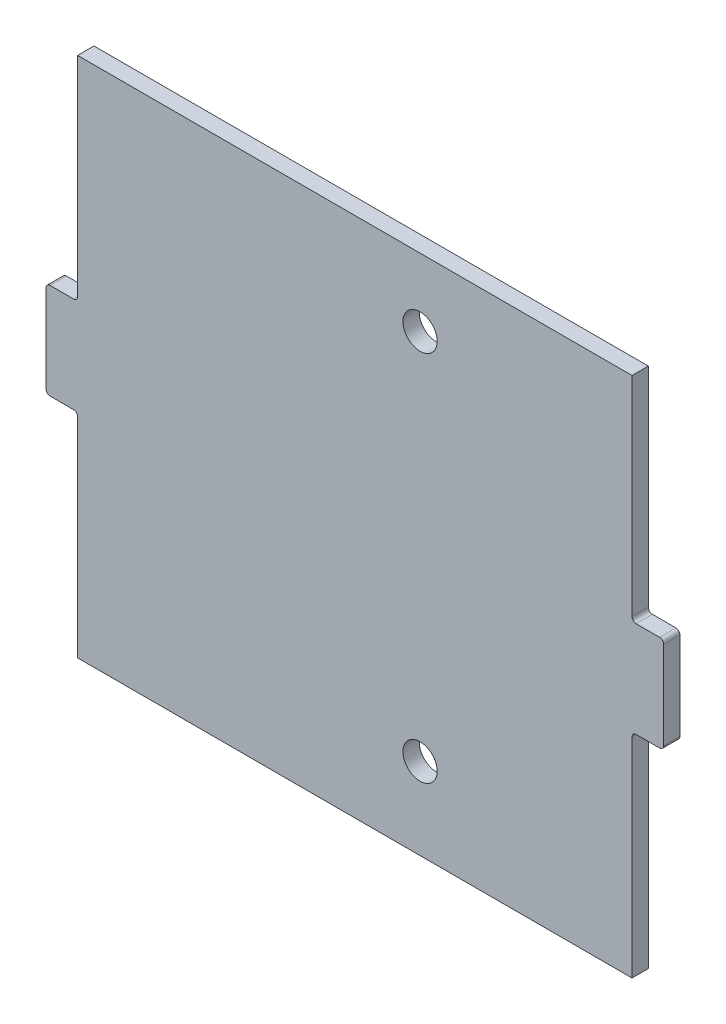
ISO-10303-21;
HEADER;
FILE_DESCRIPTION(('STEP AP214'),'2;1');
FILE_NAME('part.step','',(''),(''),'','','');
FILE_SCHEMA(('AUTOMOTIVE_DESIGN { 1 0 10303 214 1 1 1 1 }'));
ENDSEC;
DATA;
#1=APPLICATION_CONTEXT('core data for automotive mechanical design processes');
#2=APPLICATION_PROTOCOL_DEFINITION('international standard','automotive_design',2000,#1);
#3=PRODUCT_CONTEXT('',#1,'mechanical');
#4=PRODUCT('Part','Part','',(#3));
#5=PRODUCT_RELATED_PRODUCT_CATEGORY('part','',(#4));
#6=PRODUCT_DEFINITION_FORMATION('','',#4);
#7=PRODUCT_DEFINITION_CONTEXT('part definition',#1,'design');
#8=PRODUCT_DEFINITION('design','',#6,#7);
#9=PRODUCT_DEFINITION_SHAPE('','',#8);
#10=(LENGTH_UNIT() NAMED_UNIT(*) SI_UNIT(.MILLI.,.METRE.));
#11=(NAMED_UNIT(*) PLANE_ANGLE_UNIT() SI_UNIT($,.RADIAN.));
#12=(NAMED_UNIT(*) SI_UNIT($,.STERADIAN.) SOLID_ANGLE_UNIT());
#13=UNCERTAINTY_MEASURE_WITH_UNIT(LENGTH_MEASURE(1.E-05),#10,'distance_accuracy_value','');
#14=(GEOMETRIC_REPRESENTATION_CONTEXT(3) GLOBAL_UNCERTAINTY_ASSIGNED_CONTEXT((#13)) GLOBAL_UNIT_ASSIGNED_CONTEXT((#10,
#11,#12)) REPRESENTATION_CONTEXT('',''));
#15=CARTESIAN_POINT('',(0.,0.,0.));
#16=DIRECTION('',(0.,0.,1.));
#17=DIRECTION('',(1.,0.,0.));
#18=AXIS2_PLACEMENT_3D('',#15,#16,#17);
#19=CARTESIAN_POINT('',(215.9,-38.1,6.35));
#20=DIRECTION('',(-1.,0.,0.));
#21=DIRECTION('',(0.,-1.,0.));
#22=AXIS2_PLACEMENT_3D('',#19,#20,#21);
#23=PLANE('',#22);
#24=DIRECTION('',(0.,1.,0.));
#25=VECTOR('',#24,1.);
#26=CARTESIAN_POINT('',(215.9,-38.1,-6.35));
#27=LINE('',#26,#25);
#28=CARTESIAN_POINT('',(215.9,-203.2,-6.35));
#29=VERTEX_POINT('',#28);
#30=CARTESIAN_POINT('',(215.9,-40.513,-6.35));
#31=VERTEX_POINT('',#30);
#32=EDGE_CURVE('E202',#29,#31,#27,.T.);
#33=ORIENTED_EDGE('',*,*,#32,.T.);
#34=DIRECTION('',(0.,0.,-1.));
#35=VECTOR('',#34,1.);
#36=CARTESIAN_POINT('',(215.9,-40.513,6.35));
#37=LINE('',#36,#35);
#38=CARTESIAN_POINT('',(215.9,-40.513,6.35));
#39=VERTEX_POINT('',#38);
#40=EDGE_CURVE('E359',#31,#39,#37,.F.);
#41=ORIENTED_EDGE('',*,*,#40,.T.);
#42=DIRECTION('',(0.,1.,0.));
#43=VECTOR('',#42,1.);
#44=CARTESIAN_POINT('',(215.9,-38.1,6.35));
#45=LINE('',#44,#43);
#46=CARTESIAN_POINT('',(215.9,-203.2,6.35));
#47=VERTEX_POINT('',#46);
#48=EDGE_CURVE('E205',#47,#39,#45,.T.);
#49=ORIENTED_EDGE('',*,*,#48,.F.);
#50=DIRECTION('',(0.,0.,-1.));
#51=VECTOR('',#50,1.);
#52=CARTESIAN_POINT('',(215.9,-203.2,6.35));
#53=LINE('',#52,#51);
#54=EDGE_CURVE('E190',#47,#29,#53,.T.);
#55=ORIENTED_EDGE('',*,*,#54,.T.);
#56=EDGE_LOOP('',(#33,#41,#49,#55));
#57=FACE_BOUND('',#56,.T.);
#58=ADVANCED_FACE('F44',(#57),#23,.F.);
#59=CARTESIAN_POINT('',(215.9,-37.338,6.35));
#60=DIRECTION('',(0.,1.,0.));
#61=DIRECTION('',(-1.,0.,0.));
#62=AXIS2_PLACEMENT_3D('',#59,#60,#61);
#63=PLANE('',#62);
#64=DIRECTION('',(1.,0.,0.));
#65=VECTOR('',#64,1.);
#66=CARTESIAN_POINT('',(215.9,-37.338,-6.35));
#67=LINE('',#66,#65);
#68=CARTESIAN_POINT('',(219.075,-37.338,-6.35));
#69=VERTEX_POINT('',#68);
#70=CARTESIAN_POINT('',(237.363,-37.338,-6.35));
#71=VERTEX_POINT('',#70);
#72=EDGE_CURVE('E207',#69,#71,#67,.T.);
#73=ORIENTED_EDGE('',*,*,#72,.T.);
#74=DIRECTION('',(0.,0.,-1.));
#75=VECTOR('',#74,1.);
#76=CARTESIAN_POINT('',(237.363,-37.338,6.35));
#77=LINE('',#76,#75);
#78=CARTESIAN_POINT('',(237.363,-37.338,6.35));
#79=VERTEX_POINT('',#78);
#80=EDGE_CURVE('E356',#71,#79,#77,.F.);
#81=ORIENTED_EDGE('',*,*,#80,.T.);
#82=DIRECTION('',(1.,0.,0.));
#83=VECTOR('',#82,1.);
#84=CARTESIAN_POINT('',(215.9,-37.338,6.35));
#85=LINE('',#84,#83);
#86=CARTESIAN_POINT('',(219.075,-37.338,6.35));
#87=VERTEX_POINT('',#86);
#88=EDGE_CURVE('E238',#87,#79,#85,.T.);
#89=ORIENTED_EDGE('',*,*,#88,.F.);
#90=DIRECTION('',(0.,0.,-1.));
#91=VECTOR('',#90,1.);
#92=CARTESIAN_POINT('',(219.075,-37.338,-6.35));
#93=LINE('',#92,#91);
#94=EDGE_CURVE('E352',#87,#69,#93,.T.);
#95=ORIENTED_EDGE('',*,*,#94,.T.);
#96=EDGE_LOOP('',(#73,#81,#89,#95));
#97=FACE_BOUND('',#96,.T.);
#98=ADVANCED_FACE('F411',(#97),#63,.F.);
#99=CARTESIAN_POINT('',(240.538,38.1,6.35));
#100=DIRECTION('',(-1.,0.,0.));
#101=DIRECTION('',(0.,0.,1.));
#102=AXIS2_PLACEMENT_3D('',#99,#100,#101);
#103=PLANE('',#102);
#104=DIRECTION('',(0.,1.,0.));
#105=VECTOR('',#104,1.);
#106=CARTESIAN_POINT('',(240.538,38.1,-6.35));
#107=LINE('',#106,#105);
#108=CARTESIAN_POINT('',(240.538,-34.163,-6.35));
#109=VERTEX_POINT('',#108);
#110=CARTESIAN_POINT('',(240.538,34.163,-6.35));
#111=VERTEX_POINT('',#110);
#112=EDGE_CURVE('E243',#109,#111,#107,.T.);
#113=ORIENTED_EDGE('',*,*,#112,.T.);
#114=DIRECTION('',(0.,0.,-1.));
#115=VECTOR('',#114,1.);
#116=CARTESIAN_POINT('',(240.538,34.163,6.35));
#117=LINE('',#116,#115);
#118=CARTESIAN_POINT('',(240.538,34.163,6.35));
#119=VERTEX_POINT('',#118);
#120=EDGE_CURVE('E349',#111,#119,#117,.F.);
#121=ORIENTED_EDGE('',*,*,#120,.T.);
#122=DIRECTION('',(0.,1.,0.));
#123=VECTOR('',#122,1.);
#124=CARTESIAN_POINT('',(240.538,38.1,6.35));
#125=LINE('',#124,#123);
#126=CARTESIAN_POINT('',(240.538,-34.163,6.35));
#127=VERTEX_POINT('',#126);
#128=EDGE_CURVE('E247',#127,#119,#125,.T.);
#129=ORIENTED_EDGE('',*,*,#128,.F.);
#130=DIRECTION('',(0.,0.,-1.));
#131=VECTOR('',#130,1.);
#132=CARTESIAN_POINT('',(240.538,-34.163,6.35));
#133=LINE('',#132,#131);
#134=EDGE_CURVE('E345',#127,#109,#133,.T.);
#135=ORIENTED_EDGE('',*,*,#134,.T.);
#136=EDGE_LOOP('',(#113,#121,#129,#135));
#137=FACE_BOUND('',#136,.T.);
#138=ADVANCED_FACE('F416',(#137),#103,.F.);
#139=CARTESIAN_POINT('',(215.9,37.338,6.35));
#140=DIRECTION('',(0.,-1.,0.));
#141=DIRECTION('',(0.,0.,-1.));
#142=AXIS2_PLACEMENT_3D('',#139,#140,#141);
#143=PLANE('',#142);
#144=DIRECTION('',(-1.,0.,0.));
#145=VECTOR('',#144,1.);
#146=CARTESIAN_POINT('',(215.9,37.338,-6.35));
#147=LINE('',#146,#145);
#148=CARTESIAN_POINT('',(237.363,37.338,-6.35));
#149=VERTEX_POINT('',#148);
#150=CARTESIAN_POINT('',(219.075,37.338,-6.35));
#151=VERTEX_POINT('',#150);
#152=EDGE_CURVE('E254',#149,#151,#147,.T.);
#153=ORIENTED_EDGE('',*,*,#152,.T.);
#154=DIRECTION('',(0.,0.,-1.));
#155=VECTOR('',#154,1.);
#156=CARTESIAN_POINT('',(219.075,37.338,6.35));
#157=LINE('',#156,#155);
#158=CARTESIAN_POINT('',(219.075,37.338,6.35));
#159=VERTEX_POINT('',#158);
#160=EDGE_CURVE('E342',#151,#159,#157,.F.);
#161=ORIENTED_EDGE('',*,*,#160,.T.);
#162=DIRECTION('',(-1.,0.,0.));
#163=VECTOR('',#162,1.);
#164=CARTESIAN_POINT('',(215.9,37.338,6.35));
#165=LINE('',#164,#163);
#166=CARTESIAN_POINT('',(237.363,37.338,6.35));
#167=VERTEX_POINT('',#166);
#168=EDGE_CURVE('E235',#167,#159,#165,.T.);
#169=ORIENTED_EDGE('',*,*,#168,.F.);
#170=DIRECTION('',(0.,0.,-1.));
#171=VECTOR('',#170,1.);
#172=CARTESIAN_POINT('',(237.363,37.338,6.35));
#173=LINE('',#172,#171);
#174=EDGE_CURVE('E338',#167,#149,#173,.T.);
#175=ORIENTED_EDGE('',*,*,#174,.T.);
#176=EDGE_LOOP('',(#153,#161,#169,#175));
#177=FACE_BOUND('',#176,.T.);
#178=ADVANCED_FACE('F424',(#177),#143,.F.);
#179=CARTESIAN_POINT('',(215.9,203.2,6.35));
#180=DIRECTION('',(-1.,0.,0.));
#181=DIRECTION('',(0.,-1.,0.));
#182=AXIS2_PLACEMENT_3D('',#179,#180,#181);
#183=PLANE('',#182);
#184=DIRECTION('',(0.,1.,0.));
#185=VECTOR('',#184,1.);
#186=CARTESIAN_POINT('',(215.9,203.2,6.35));
#187=LINE('',#186,#185);
#188=CARTESIAN_POINT('',(215.9,40.513,6.35));
#189=VERTEX_POINT('',#188);
#190=CARTESIAN_POINT('',(215.9,203.2,6.35));
#191=VERTEX_POINT('',#190);
#192=EDGE_CURVE('E232',#189,#191,#187,.T.);
#193=ORIENTED_EDGE('',*,*,#192,.F.);
#194=DIRECTION('',(0.,0.,-1.));
#195=VECTOR('',#194,1.);
#196=CARTESIAN_POINT('',(215.9,40.513,-6.35));
#197=LINE('',#196,#195);
#198=CARTESIAN_POINT('',(215.9,40.513,-6.35));
#199=VERTEX_POINT('',#198);
#200=EDGE_CURVE('E334',#189,#199,#197,.T.);
#201=ORIENTED_EDGE('',*,*,#200,.T.);
#202=DIRECTION('',(0.,1.,0.));
#203=VECTOR('',#202,1.);
#204=CARTESIAN_POINT('',(215.9,203.2,-6.35));
#205=LINE('',#204,#203);
#206=CARTESIAN_POINT('',(215.9,203.2,-6.35));
#207=VERTEX_POINT('',#206);
#208=EDGE_CURVE('E216',#199,#207,#205,.T.);
#209=ORIENTED_EDGE('',*,*,#208,.T.);
#210=DIRECTION('',(0.,0.,-1.));
#211=VECTOR('',#210,1.);
#212=CARTESIAN_POINT('',(215.9,203.2,6.35));
#213=LINE('',#212,#211);
#214=EDGE_CURVE('E571',#191,#207,#213,.T.);
#215=ORIENTED_EDGE('',*,*,#214,.F.);
#216=EDGE_LOOP('',(#193,#201,#209,#215));
#217=FACE_BOUND('',#216,.T.);
#218=ADVANCED_FACE('F420',(#217),#183,.F.);
#219=CARTESIAN_POINT('',(-215.9,203.2,6.35));
#220=DIRECTION('',(0.,-1.,0.));
#221=DIRECTION('',(0.,0.,-1.));
#222=AXIS2_PLACEMENT_3D('',#219,#220,#221);
#223=PLANE('',#222);
#224=DIRECTION('',(-1.,0.,0.));
#225=VECTOR('',#224,1.);
#226=CARTESIAN_POINT('',(-215.9,203.2,-6.35));
#227=LINE('',#226,#225);
#228=CARTESIAN_POINT('',(-215.9,203.2,-6.35));
#229=VERTEX_POINT('',#228);
#230=EDGE_CURVE('E576',#207,#229,#227,.T.);
#231=ORIENTED_EDGE('',*,*,#230,.T.);
#232=DIRECTION('',(0.,0.,-1.));
#233=VECTOR('',#232,1.);
#234=CARTESIAN_POINT('',(-215.9,203.2,6.35));
#235=LINE('',#234,#233);
#236=CARTESIAN_POINT('',(-215.9,203.2,6.35));
#237=VERTEX_POINT('',#236);
#238=EDGE_CURVE('E265',#237,#229,#235,.T.);
#239=ORIENTED_EDGE('',*,*,#238,.F.);
#240=DIRECTION('',(-1.,0.,0.));
#241=VECTOR('',#240,1.);
#242=CARTESIAN_POINT('',(-215.9,203.2,6.35));
#243=LINE('',#242,#241);
#244=EDGE_CURVE('E229',#191,#237,#243,.T.);
#245=ORIENTED_EDGE('',*,*,#244,.F.);
#246=ORIENTED_EDGE('',*,*,#214,.T.);
#247=EDGE_LOOP('',(#231,#239,#245,#246));
#248=FACE_BOUND('',#247,.T.);
#249=ADVANCED_FACE('F423',(#248),#223,.F.);
#250=CARTESIAN_POINT('',(-215.9,203.2,6.35));
#251=DIRECTION('',(1.,0.,0.));
#252=DIRECTION('',(0.,0.,-1.));
#253=AXIS2_PLACEMENT_3D('',#250,#251,#252);
#254=PLANE('',#253);
#255=DIRECTION('',(0.,-1.,0.));
#256=VECTOR('',#255,1.);
#257=CARTESIAN_POINT('',(-215.9,203.2,-6.35));
#258=LINE('',#257,#256);
#259=CARTESIAN_POINT('',(-215.9,40.513,-6.35));
#260=VERTEX_POINT('',#259);
#261=EDGE_CURVE('E575',#229,#260,#258,.T.);
#262=ORIENTED_EDGE('',*,*,#261,.T.);
#263=DIRECTION('',(0.,0.,-1.));
#264=VECTOR('',#263,1.);
#265=CARTESIAN_POINT('',(-215.9,40.513,6.35));
#266=LINE('',#265,#264);
#267=CARTESIAN_POINT('',(-215.9,40.513,6.35));
#268=VERTEX_POINT('',#267);
#269=EDGE_CURVE('E331',#260,#268,#266,.F.);
#270=ORIENTED_EDGE('',*,*,#269,.T.);
#271=DIRECTION('',(0.,-1.,0.));
#272=VECTOR('',#271,1.);
#273=CARTESIAN_POINT('',(-215.9,203.2,6.35));
#274=LINE('',#273,#272);
#275=EDGE_CURVE('E225',#237,#268,#274,.T.);
#276=ORIENTED_EDGE('',*,*,#275,.F.);
#277=ORIENTED_EDGE('',*,*,#238,.T.);
#278=EDGE_LOOP('',(#262,#270,#276,#277));
#279=FACE_BOUND('',#278,.T.);
#280=ADVANCED_FACE('F428',(#279),#254,.F.);
#281=CARTESIAN_POINT('',(-215.9,37.338,6.35));
#282=DIRECTION('',(0.,-1.,0.));
#283=DIRECTION('',(1.,0.,0.));
#284=AXIS2_PLACEMENT_3D('',#281,#282,#283);
#285=PLANE('',#284);
#286=DIRECTION('',(-1.,0.,0.));
#287=VECTOR('',#286,1.);
#288=CARTESIAN_POINT('',(-215.9,37.338,6.35));
#289=LINE('',#288,#287);
#290=CARTESIAN_POINT('',(-219.075,37.338,6.35));
#291=VERTEX_POINT('',#290);
#292=CARTESIAN_POINT('',(-237.363,37.338,6.35));
#293=VERTEX_POINT('',#292);
#294=EDGE_CURVE('E228',#291,#293,#289,.T.);
#295=ORIENTED_EDGE('',*,*,#294,.F.);
#296=DIRECTION('',(0.,0.,-1.));
#297=VECTOR('',#296,1.);
#298=CARTESIAN_POINT('',(-219.075,37.338,-6.35));
#299=LINE('',#298,#297);
#300=CARTESIAN_POINT('',(-219.075,37.338,-6.35));
#301=VERTEX_POINT('',#300);
#302=EDGE_CURVE('E327',#291,#301,#299,.T.);
#303=ORIENTED_EDGE('',*,*,#302,.T.);
#304=DIRECTION('',(-1.,0.,0.));
#305=VECTOR('',#304,1.);
#306=CARTESIAN_POINT('',(-215.9,37.338,-6.35));
#307=LINE('',#306,#305);
#308=CARTESIAN_POINT('',(-237.363,37.338,-6.35));
#309=VERTEX_POINT('',#308);
#310=EDGE_CURVE('E261',#301,#309,#307,.T.);
#311=ORIENTED_EDGE('',*,*,#310,.T.);
#312=DIRECTION('',(0.,0.,-1.));
#313=VECTOR('',#312,1.);
#314=CARTESIAN_POINT('',(-237.363,37.338,6.35));
#315=LINE('',#314,#313);
#316=EDGE_CURVE('E62',#309,#293,#315,.F.);
#317=ORIENTED_EDGE('',*,*,#316,.T.);
#318=EDGE_LOOP('',(#295,#303,#311,#317));
#319=FACE_BOUND('',#318,.T.);
#320=ADVANCED_FACE('F432',(#319),#285,.F.);
#321=CARTESIAN_POINT('',(-240.538,38.1,6.35));
#322=DIRECTION('',(1.,0.,0.));
#323=DIRECTION('',(0.,0.,-1.));
#324=AXIS2_PLACEMENT_3D('',#321,#322,#323);
#325=PLANE('',#324);
#326=DIRECTION('',(0.,-1.,0.));
#327=VECTOR('',#326,1.);
#328=CARTESIAN_POINT('',(-240.538,38.1,-6.35));
#329=LINE('',#328,#327);
#330=CARTESIAN_POINT('',(-240.538,34.163,-6.35));
#331=VERTEX_POINT('',#330);
#332=CARTESIAN_POINT('',(-240.538,-34.163,-6.35));
#333=VERTEX_POINT('',#332);
#334=EDGE_CURVE('E264',#331,#333,#329,.T.);
#335=ORIENTED_EDGE('',*,*,#334,.T.);
#336=DIRECTION('',(0.,0.,-1.));
#337=VECTOR('',#336,1.);
#338=CARTESIAN_POINT('',(-240.538,-34.163,6.35));
#339=LINE('',#338,#337);
#340=CARTESIAN_POINT('',(-240.538,-34.163,6.35));
#341=VERTEX_POINT('',#340);
#342=EDGE_CURVE('E310',#333,#341,#339,.F.);
#343=ORIENTED_EDGE('',*,*,#342,.T.);
#344=DIRECTION('',(0.,-1.,0.));
#345=VECTOR('',#344,1.);
#346=CARTESIAN_POINT('',(-240.538,38.1,6.35));
#347=LINE('',#346,#345);
#348=CARTESIAN_POINT('',(-240.538,34.163,6.35));
#349=VERTEX_POINT('',#348);
#350=EDGE_CURVE('E268',#349,#341,#347,.T.);
#351=ORIENTED_EDGE('',*,*,#350,.F.);
#352=DIRECTION('',(0.,0.,-1.));
#353=VECTOR('',#352,1.);
#354=CARTESIAN_POINT('',(-240.538,34.163,6.35));
#355=LINE('',#354,#353);
#356=EDGE_CURVE('E306',#349,#331,#355,.T.);
#357=ORIENTED_EDGE('',*,*,#356,.T.);
#358=EDGE_LOOP('',(#335,#343,#351,#357));
#359=FACE_BOUND('',#358,.T.);
#360=ADVANCED_FACE('F541',(#359),#325,.F.);
#361=CARTESIAN_POINT('',(-215.9,-37.338,6.35));
#362=DIRECTION('',(0.,1.,0.));
#363=DIRECTION('',(-1.,0.,0.));
#364=AXIS2_PLACEMENT_3D('',#361,#362,#363);
#365=PLANE('',#364);
#366=DIRECTION('',(1.,0.,0.));
#367=VECTOR('',#366,1.);
#368=CARTESIAN_POINT('',(-215.9,-37.338,-6.35));
#369=LINE('',#368,#367);
#370=CARTESIAN_POINT('',(-237.363,-37.338,-6.35));
#371=VERTEX_POINT('',#370);
#372=CARTESIAN_POINT('',(-219.075,-37.338,-6.35));
#373=VERTEX_POINT('',#372);
#374=EDGE_CURVE('E275',#371,#373,#369,.T.);
#375=ORIENTED_EDGE('',*,*,#374,.T.);
#376=DIRECTION('',(0.,0.,-1.));
#377=VECTOR('',#376,1.);
#378=CARTESIAN_POINT('',(-219.075,-37.338,6.35));
#379=LINE('',#378,#377);
#380=CARTESIAN_POINT('',(-219.075,-37.338,6.35));
#381=VERTEX_POINT('',#380);
#382=EDGE_CURVE('E291',#373,#381,#379,.F.);
#383=ORIENTED_EDGE('',*,*,#382,.T.);
#384=DIRECTION('',(1.,0.,0.));
#385=VECTOR('',#384,1.);
#386=CARTESIAN_POINT('',(-215.9,-37.338,6.35));
#387=LINE('',#386,#385);
#388=CARTESIAN_POINT('',(-237.363,-37.338,6.35));
#389=VERTEX_POINT('',#388);
#390=EDGE_CURVE('E224',#389,#381,#387,.T.);
#391=ORIENTED_EDGE('',*,*,#390,.F.);
#392=DIRECTION('',(0.,0.,-1.));
#393=VECTOR('',#392,1.);
#394=CARTESIAN_POINT('',(-237.363,-37.338,6.35));
#395=LINE('',#394,#393);
#396=EDGE_CURVE('E286',#389,#371,#395,.T.);
#397=ORIENTED_EDGE('',*,*,#396,.T.);
#398=EDGE_LOOP('',(#375,#383,#391,#397));
#399=FACE_BOUND('',#398,.T.);
#400=ADVANCED_FACE('F436',(#399),#365,.F.);
#401=CARTESIAN_POINT('',(-215.9,-38.1,6.35));
#402=DIRECTION('',(1.,0.,0.));
#403=DIRECTION('',(0.,1.,0.));
#404=AXIS2_PLACEMENT_3D('',#401,#402,#403);
#405=PLANE('',#404);
#406=DIRECTION('',(0.,-1.,0.));
#407=VECTOR('',#406,1.);
#408=CARTESIAN_POINT('',(-215.9,-38.1,6.35));
#409=LINE('',#408,#407);
#410=CARTESIAN_POINT('',(-215.9,-40.513,6.35));
#411=VERTEX_POINT('',#410);
#412=CARTESIAN_POINT('',(-215.9,-203.2,6.35));
#413=VERTEX_POINT('',#412);
#414=EDGE_CURVE('E221',#411,#413,#409,.T.);
#415=ORIENTED_EDGE('',*,*,#414,.F.);
#416=DIRECTION('',(0.,0.,-1.));
#417=VECTOR('',#416,1.);
#418=CARTESIAN_POINT('',(-215.9,-40.513,-6.35));
#419=LINE('',#418,#417);
#420=CARTESIAN_POINT('',(-215.9,-40.513,-6.35));
#421=VERTEX_POINT('',#420);
#422=EDGE_CURVE('E282',#411,#421,#419,.T.);
#423=ORIENTED_EDGE('',*,*,#422,.T.);
#424=DIRECTION('',(0.,-1.,0.));
#425=VECTOR('',#424,1.);
#426=CARTESIAN_POINT('',(-215.9,-38.1,-6.35));
#427=LINE('',#426,#425);
#428=CARTESIAN_POINT('',(-215.9,-203.2,-6.35));
#429=VERTEX_POINT('',#428);
#430=EDGE_CURVE('E198',#421,#429,#427,.T.);
#431=ORIENTED_EDGE('',*,*,#430,.T.);
#432=DIRECTION('',(0.,0.,-1.));
#433=VECTOR('',#432,1.);
#434=CARTESIAN_POINT('',(-215.9,-203.2,6.35));
#435=LINE('',#434,#433);
#436=EDGE_CURVE('E193',#413,#429,#435,.T.);
#437=ORIENTED_EDGE('',*,*,#436,.F.);
#438=EDGE_LOOP('',(#415,#423,#431,#437));
#439=FACE_BOUND('',#438,.T.);
#440=ADVANCED_FACE('F434',(#439),#405,.F.);
#441=CARTESIAN_POINT('',(-215.9,-203.2,6.35));
#442=DIRECTION('',(0.,1.,0.));
#443=DIRECTION('',(0.,0.,1.));
#444=AXIS2_PLACEMENT_3D('',#441,#442,#443);
#445=PLANE('',#444);
#446=DIRECTION('',(1.,0.,0.));
#447=VECTOR('',#446,1.);
#448=CARTESIAN_POINT('',(-215.9,-203.2,-6.35));
#449=LINE('',#448,#447);
#450=EDGE_CURVE('E186',#429,#29,#449,.T.);
#451=ORIENTED_EDGE('',*,*,#450,.T.);
#452=ORIENTED_EDGE('',*,*,#54,.F.);
#453=DIRECTION('',(1.,0.,0.));
#454=VECTOR('',#453,1.);
#455=CARTESIAN_POINT('',(-215.9,-203.2,6.35));
#456=LINE('',#455,#454);
#457=EDGE_CURVE('E218',#413,#47,#456,.T.);
#458=ORIENTED_EDGE('',*,*,#457,.F.);
#459=ORIENTED_EDGE('',*,*,#436,.T.);
#460=EDGE_LOOP('',(#451,#452,#458,#459));
#461=FACE_BOUND('',#460,.T.);
#462=ADVANCED_FACE('F188',(#461),#445,.F.);
#463=CARTESIAN_POINT('',(0.,0.,6.35));
#464=DIRECTION('',(0.,0.,1.));
#465=DIRECTION('',(1.,0.,0.));
#466=AXIS2_PLACEMENT_3D('',#463,#464,#465);
#467=PLANE('',#466);
#468=CARTESIAN_POINT('',(50.8000000000004,150.299999999983,6.34999999999999));
#469=DIRECTION('',(0.,0.,1.));
#470=DIRECTION('',(1.,0.,0.));
#471=AXIS2_PLACEMENT_3D('',#468,#469,#470);
#472=CIRCLE('',#471,13.3350000000001);
#473=CARTESIAN_POINT('',(64.1350000000005,150.299999999983,6.34999999999999));
#474=VERTEX_POINT('',#473);
#475=EDGE_CURVE('E381',#474,#474,#472,.F.);
#476=ORIENTED_EDGE('',*,*,#475,.T.);
#477=EDGE_LOOP('',(#476));
#478=FACE_BOUND('',#477,.T.);
#479=CARTESIAN_POINT('',(50.8000000000004,-139.700000000005,6.34999999999999));
#480=DIRECTION('',(0.,0.,1.));
#481=DIRECTION('',(1.,0.,0.));
#482=AXIS2_PLACEMENT_3D('',#479,#480,#481);
#483=CIRCLE('',#482,13.3350000000001);
#484=CARTESIAN_POINT('',(64.1350000000005,-139.700000000005,6.34999999999999));
#485=VERTEX_POINT('',#484);
#486=EDGE_CURVE('E239',#485,#485,#483,.F.);
#487=ORIENTED_EDGE('',*,*,#486,.T.);
#488=EDGE_LOOP('',(#487));
#489=FACE_BOUND('',#488,.T.);
#490=ORIENTED_EDGE('',*,*,#350,.T.);
#491=CARTESIAN_POINT('',(-237.363,-34.163,6.35));
#492=DIRECTION('',(0.,0.,1.));
#493=DIRECTION('',(1.,0.,0.));
#494=AXIS2_PLACEMENT_3D('',#491,#492,#493);
#495=CIRCLE('',#494,3.175);
#496=EDGE_CURVE('E322',#341,#389,#495,.T.);
#497=ORIENTED_EDGE('',*,*,#496,.T.);
#498=ORIENTED_EDGE('',*,*,#390,.T.);
#499=CARTESIAN_POINT('',(-219.075,-40.513,6.35));
#500=DIRECTION('',(0.,0.,1.));
#501=DIRECTION('',(1.,0.,0.));
#502=AXIS2_PLACEMENT_3D('',#499,#500,#501);
#503=CIRCLE('',#502,3.175);
#504=EDGE_CURVE('E365',#381,#411,#503,.F.);
#505=ORIENTED_EDGE('',*,*,#504,.T.);
#506=ORIENTED_EDGE('',*,*,#414,.T.);
#507=ORIENTED_EDGE('',*,*,#457,.T.);
#508=ORIENTED_EDGE('',*,*,#48,.T.);
#509=CARTESIAN_POINT('',(219.075,-40.513,6.35));
#510=DIRECTION('',(0.,0.,1.));
#511=DIRECTION('',(1.,0.,0.));
#512=AXIS2_PLACEMENT_3D('',#509,#510,#511);
#513=CIRCLE('',#512,3.175);
#514=EDGE_CURVE('E12',#39,#87,#513,.F.);
#515=ORIENTED_EDGE('',*,*,#514,.T.);
#516=ORIENTED_EDGE('',*,*,#88,.T.);
#517=CARTESIAN_POINT('',(237.363,-34.163,6.35));
#518=DIRECTION('',(0.,0.,1.));
#519=DIRECTION('',(1.,0.,0.));
#520=AXIS2_PLACEMENT_3D('',#517,#518,#519);
#521=CIRCLE('',#520,3.175);
#522=EDGE_CURVE('E316',#79,#127,#521,.T.);
#523=ORIENTED_EDGE('',*,*,#522,.T.);
#524=ORIENTED_EDGE('',*,*,#128,.T.);
#525=CARTESIAN_POINT('',(237.363,34.163,6.35));
#526=DIRECTION('',(0.,0.,1.));
#527=DIRECTION('',(1.,0.,0.));
#528=AXIS2_PLACEMENT_3D('',#525,#526,#527);
#529=CIRCLE('',#528,3.175);
#530=EDGE_CURVE('E319',#119,#167,#529,.T.);
#531=ORIENTED_EDGE('',*,*,#530,.T.);
#532=ORIENTED_EDGE('',*,*,#168,.T.);
#533=CARTESIAN_POINT('',(219.075,40.513,6.35));
#534=DIRECTION('',(0.,0.,1.));
#535=DIRECTION('',(1.,0.,0.));
#536=AXIS2_PLACEMENT_3D('',#533,#534,#535);
#537=CIRCLE('',#536,3.175);
#538=EDGE_CURVE('E376',#159,#189,#537,.F.);
#539=ORIENTED_EDGE('',*,*,#538,.T.);
#540=ORIENTED_EDGE('',*,*,#192,.T.);
#541=ORIENTED_EDGE('',*,*,#244,.T.);
#542=ORIENTED_EDGE('',*,*,#275,.T.);
#543=CARTESIAN_POINT('',(-219.075,40.513,6.35));
#544=DIRECTION('',(0.,0.,1.));
#545=DIRECTION('',(1.,0.,0.));
#546=AXIS2_PLACEMENT_3D('',#543,#544,#545);
#547=CIRCLE('',#546,3.175);
#548=EDGE_CURVE('E69',#268,#291,#547,.F.);
#549=ORIENTED_EDGE('',*,*,#548,.T.);
#550=ORIENTED_EDGE('',*,*,#294,.T.);
#551=CARTESIAN_POINT('',(-237.363,34.163,6.35));
#552=DIRECTION('',(0.,0.,1.));
#553=DIRECTION('',(1.,0.,0.));
#554=AXIS2_PLACEMENT_3D('',#551,#552,#553);
#555=CIRCLE('',#554,3.175);
#556=EDGE_CURVE('E313',#293,#349,#555,.T.);
#557=ORIENTED_EDGE('',*,*,#556,.T.);
#558=EDGE_LOOP('',(#490,#497,#498,#505,#506,#507,#508,#515,#516,#523,#524,#531,#532,#539,#540,
#541,#542,#549,#550,#557));
#559=FACE_BOUND('',#558,.T.);
#560=ADVANCED_FACE('F391',(#478,#489,#559),#467,.T.);
#561=CARTESIAN_POINT('',(0.,0.,-6.35));
#562=DIRECTION('',(0.,0.,1.));
#563=DIRECTION('',(1.,0.,0.));
#564=AXIS2_PLACEMENT_3D('',#561,#562,#563);
#565=PLANE('',#564);
#566=CARTESIAN_POINT('',(50.8000000000004,150.299999999983,-6.35000000000002));
#567=DIRECTION('',(0.,0.,1.));
#568=DIRECTION('',(1.,0.,0.));
#569=AXIS2_PLACEMENT_3D('',#566,#567,#568);
#570=CIRCLE('',#569,13.3350000000001);
#571=CARTESIAN_POINT('',(64.1350000000005,150.299999999983,-6.35000000000002));
#572=VERTEX_POINT('',#571);
#573=EDGE_CURVE('E287',#572,#572,#570,.F.);
#574=ORIENTED_EDGE('',*,*,#573,.F.);
#575=EDGE_LOOP('',(#574));
#576=FACE_BOUND('',#575,.T.);
#577=CARTESIAN_POINT('',(50.8000000000004,-139.700000000005,-6.34999999999999));
#578=DIRECTION('',(0.,0.,1.));
#579=DIRECTION('',(1.,0.,0.));
#580=AXIS2_PLACEMENT_3D('',#577,#578,#579);
#581=CIRCLE('',#580,13.3350000000001);
#582=CARTESIAN_POINT('',(64.1350000000005,-139.700000000005,-6.34999999999999));
#583=VERTEX_POINT('',#582);
#584=EDGE_CURVE('E48',#583,#583,#581,.F.);
#585=ORIENTED_EDGE('',*,*,#584,.F.);
#586=EDGE_LOOP('',(#585));
#587=FACE_BOUND('',#586,.T.);
#588=ORIENTED_EDGE('',*,*,#374,.F.);
#589=CARTESIAN_POINT('',(-237.363,-34.163,-6.35));
#590=DIRECTION('',(0.,0.,1.));
#591=DIRECTION('',(1.,0.,0.));
#592=AXIS2_PLACEMENT_3D('',#589,#590,#591);
#593=CIRCLE('',#592,3.175);
#594=EDGE_CURVE('E303',#371,#333,#593,.F.);
#595=ORIENTED_EDGE('',*,*,#594,.T.);
#596=ORIENTED_EDGE('',*,*,#334,.F.);
#597=CARTESIAN_POINT('',(-237.363,34.163,-6.35));
#598=DIRECTION('',(0.,0.,1.));
#599=DIRECTION('',(1.,0.,0.));
#600=AXIS2_PLACEMENT_3D('',#597,#598,#599);
#601=CIRCLE('',#600,3.175);
#602=EDGE_CURVE('E294',#331,#309,#601,.F.);
#603=ORIENTED_EDGE('',*,*,#602,.T.);
#604=ORIENTED_EDGE('',*,*,#310,.F.);
#605=CARTESIAN_POINT('',(-219.075,40.513,-6.35));
#606=DIRECTION('',(0.,0.,1.));
#607=DIRECTION('',(1.,0.,0.));
#608=AXIS2_PLACEMENT_3D('',#605,#606,#607);
#609=CIRCLE('',#608,3.175);
#610=EDGE_CURVE('E368',#301,#260,#609,.T.);
#611=ORIENTED_EDGE('',*,*,#610,.T.);
#612=ORIENTED_EDGE('',*,*,#261,.F.);
#613=ORIENTED_EDGE('',*,*,#230,.F.);
#614=ORIENTED_EDGE('',*,*,#208,.F.);
#615=CARTESIAN_POINT('',(219.075,40.513,-6.35));
#616=DIRECTION('',(0.,0.,1.));
#617=DIRECTION('',(1.,0.,0.));
#618=AXIS2_PLACEMENT_3D('',#615,#616,#617);
#619=CIRCLE('',#618,3.175);
#620=EDGE_CURVE('E373',#199,#151,#619,.T.);
#621=ORIENTED_EDGE('',*,*,#620,.T.);
#622=ORIENTED_EDGE('',*,*,#152,.F.);
#623=CARTESIAN_POINT('',(237.363,34.163,-6.35));
#624=DIRECTION('',(0.,0.,1.));
#625=DIRECTION('',(1.,0.,0.));
#626=AXIS2_PLACEMENT_3D('',#623,#624,#625);
#627=CIRCLE('',#626,3.175);
#628=EDGE_CURVE('E300',#149,#111,#627,.F.);
#629=ORIENTED_EDGE('',*,*,#628,.T.);
#630=ORIENTED_EDGE('',*,*,#112,.F.);
#631=CARTESIAN_POINT('',(237.363,-34.163,-6.35));
#632=DIRECTION('',(0.,0.,1.));
#633=DIRECTION('',(1.,0.,0.));
#634=AXIS2_PLACEMENT_3D('',#631,#632,#633);
#635=CIRCLE('',#634,3.175);
#636=EDGE_CURVE('E297',#109,#71,#635,.F.);
#637=ORIENTED_EDGE('',*,*,#636,.T.);
#638=ORIENTED_EDGE('',*,*,#72,.F.);
#639=CARTESIAN_POINT('',(219.075,-40.513,-6.35));
#640=DIRECTION('',(0.,0.,1.));
#641=DIRECTION('',(1.,0.,0.));
#642=AXIS2_PLACEMENT_3D('',#639,#640,#641);
#643=CIRCLE('',#642,3.175);
#644=EDGE_CURVE('E54',#69,#31,#643,.T.);
#645=ORIENTED_EDGE('',*,*,#644,.T.);
#646=ORIENTED_EDGE('',*,*,#32,.F.);
#647=ORIENTED_EDGE('',*,*,#450,.F.);
#648=ORIENTED_EDGE('',*,*,#430,.F.);
#649=CARTESIAN_POINT('',(-219.075,-40.513,-6.35));
#650=DIRECTION('',(0.,0.,1.));
#651=DIRECTION('',(1.,0.,0.));
#652=AXIS2_PLACEMENT_3D('',#649,#650,#651);
#653=CIRCLE('',#652,3.175);
#654=EDGE_CURVE('E362',#421,#373,#653,.T.);
#655=ORIENTED_EDGE('',*,*,#654,.T.);
#656=EDGE_LOOP('',(#588,#595,#596,#603,#604,#611,#612,#613,#614,#621,#622,#629,#630,#637,#638,
#645,#646,#647,#648,#655));
#657=FACE_BOUND('',#656,.T.);
#658=ADVANCED_FACE('F210',(#576,#587,#657),#565,.F.);
#659=CARTESIAN_POINT('',(50.8000000000004,-139.700000000005,173.4));
#660=DIRECTION('',(0.,0.,-1.));
#661=DIRECTION('',(-1.,0.,0.));
#662=AXIS2_PLACEMENT_3D('',#659,#660,#661);
#663=CYLINDRICAL_SURFACE('',#662,13.3350000000001);
#664=ORIENTED_EDGE('',*,*,#486,.F.);
#665=EDGE_LOOP('',(#664));
#666=FACE_BOUND('',#665,.T.);
#667=ORIENTED_EDGE('',*,*,#584,.T.);
#668=EDGE_LOOP('',(#667));
#669=FACE_BOUND('',#668,.T.);
#670=ADVANCED_FACE('F46',(#666,#669),#663,.F.);
#671=CARTESIAN_POINT('',(50.8000000000004,150.299999999983,248.4));
#672=DIRECTION('',(0.,0.,-1.));
#673=DIRECTION('',(-1.,0.,0.));
#674=AXIS2_PLACEMENT_3D('',#671,#672,#673);
#675=CYLINDRICAL_SURFACE('',#674,13.3350000000001);
#676=ORIENTED_EDGE('',*,*,#475,.F.);
#677=EDGE_LOOP('',(#676));
#678=FACE_BOUND('',#677,.T.);
#679=ORIENTED_EDGE('',*,*,#573,.T.);
#680=EDGE_LOOP('',(#679));
#681=FACE_BOUND('',#680,.T.);
#682=ADVANCED_FACE('F395',(#678,#681),#675,.F.);
#683=CARTESIAN_POINT('',(-219.075,-40.513,6.35));
#684=DIRECTION('',(0.,0.,1.));
#685=DIRECTION('',(1.,0.,0.));
#686=AXIS2_PLACEMENT_3D('',#683,#684,#685);
#687=CYLINDRICAL_SURFACE('',#686,3.175);
#688=ORIENTED_EDGE('',*,*,#504,.F.);
#689=ORIENTED_EDGE('',*,*,#382,.F.);
#690=ORIENTED_EDGE('',*,*,#654,.F.);
#691=ORIENTED_EDGE('',*,*,#422,.F.);
#692=EDGE_LOOP('',(#688,#689,#690,#691));
#693=FACE_BOUND('',#692,.T.);
#694=ADVANCED_FACE('F476',(#693),#687,.F.);
#695=CARTESIAN_POINT('',(-237.363,-34.163,6.35));
#696=DIRECTION('',(0.,0.,-1.));
#697=DIRECTION('',(-1.,0.,0.));
#698=AXIS2_PLACEMENT_3D('',#695,#696,#697);
#699=CYLINDRICAL_SURFACE('',#698,3.175);
#700=ORIENTED_EDGE('',*,*,#496,.F.);
#701=ORIENTED_EDGE('',*,*,#342,.F.);
#702=ORIENTED_EDGE('',*,*,#594,.F.);
#703=ORIENTED_EDGE('',*,*,#396,.F.);
#704=EDGE_LOOP('',(#700,#701,#702,#703));
#705=FACE_BOUND('',#704,.T.);
#706=ADVANCED_FACE('F487',(#705),#699,.T.);
#707=CARTESIAN_POINT('',(-219.075,40.513,6.35));
#708=DIRECTION('',(0.,0.,1.));
#709=DIRECTION('',(1.,0.,0.));
#710=AXIS2_PLACEMENT_3D('',#707,#708,#709);
#711=CYLINDRICAL_SURFACE('',#710,3.175);
#712=ORIENTED_EDGE('',*,*,#548,.F.);
#713=ORIENTED_EDGE('',*,*,#269,.F.);
#714=ORIENTED_EDGE('',*,*,#610,.F.);
#715=ORIENTED_EDGE('',*,*,#302,.F.);
#716=EDGE_LOOP('',(#712,#713,#714,#715));
#717=FACE_BOUND('',#716,.T.);
#718=ADVANCED_FACE('F494',(#717),#711,.F.);
#719=CARTESIAN_POINT('',(219.075,40.513,6.35));
#720=DIRECTION('',(0.,0.,1.));
#721=DIRECTION('',(1.,0.,0.));
#722=AXIS2_PLACEMENT_3D('',#719,#720,#721);
#723=CYLINDRICAL_SURFACE('',#722,3.175);
#724=ORIENTED_EDGE('',*,*,#538,.F.);
#725=ORIENTED_EDGE('',*,*,#160,.F.);
#726=ORIENTED_EDGE('',*,*,#620,.F.);
#727=ORIENTED_EDGE('',*,*,#200,.F.);
#728=EDGE_LOOP('',(#724,#725,#726,#727));
#729=FACE_BOUND('',#728,.T.);
#730=ADVANCED_FACE('F502',(#729),#723,.F.);
#731=CARTESIAN_POINT('',(237.363,34.163,6.35));
#732=DIRECTION('',(0.,0.,-1.));
#733=DIRECTION('',(-1.,0.,0.));
#734=AXIS2_PLACEMENT_3D('',#731,#732,#733);
#735=CYLINDRICAL_SURFACE('',#734,3.175);
#736=ORIENTED_EDGE('',*,*,#530,.F.);
#737=ORIENTED_EDGE('',*,*,#120,.F.);
#738=ORIENTED_EDGE('',*,*,#628,.F.);
#739=ORIENTED_EDGE('',*,*,#174,.F.);
#740=EDGE_LOOP('',(#736,#737,#738,#739));
#741=FACE_BOUND('',#740,.T.);
#742=ADVANCED_FACE('F510',(#741),#735,.T.);
#743=CARTESIAN_POINT('',(237.363,-34.163,6.35));
#744=DIRECTION('',(0.,0.,-1.));
#745=DIRECTION('',(-1.,0.,0.));
#746=AXIS2_PLACEMENT_3D('',#743,#744,#745);
#747=CYLINDRICAL_SURFACE('',#746,3.175);
#748=ORIENTED_EDGE('',*,*,#522,.F.);
#749=ORIENTED_EDGE('',*,*,#80,.F.);
#750=ORIENTED_EDGE('',*,*,#636,.F.);
#751=ORIENTED_EDGE('',*,*,#134,.F.);
#752=EDGE_LOOP('',(#748,#749,#750,#751));
#753=FACE_BOUND('',#752,.T.);
#754=ADVANCED_FACE('F518',(#753),#747,.T.);
#755=CARTESIAN_POINT('',(219.075,-40.513,6.35));
#756=DIRECTION('',(0.,0.,1.));
#757=DIRECTION('',(1.,0.,0.));
#758=AXIS2_PLACEMENT_3D('',#755,#756,#757);
#759=CYLINDRICAL_SURFACE('',#758,3.175);
#760=ORIENTED_EDGE('',*,*,#514,.F.);
#761=ORIENTED_EDGE('',*,*,#40,.F.);
#762=ORIENTED_EDGE('',*,*,#644,.F.);
#763=ORIENTED_EDGE('',*,*,#94,.F.);
#764=EDGE_LOOP('',(#760,#761,#762,#763));
#765=FACE_BOUND('',#764,.T.);
#766=ADVANCED_FACE('F526',(#765),#759,.F.);
#767=CARTESIAN_POINT('',(-237.363,34.163,6.35));
#768=DIRECTION('',(0.,0.,-1.));
#769=DIRECTION('',(-1.,0.,0.));
#770=AXIS2_PLACEMENT_3D('',#767,#768,#769);
#771=CYLINDRICAL_SURFACE('',#770,3.175);
#772=ORIENTED_EDGE('',*,*,#556,.F.);
#773=ORIENTED_EDGE('',*,*,#316,.F.);
#774=ORIENTED_EDGE('',*,*,#602,.F.);
#775=ORIENTED_EDGE('',*,*,#356,.F.);
#776=EDGE_LOOP('',(#772,#773,#774,#775));
#777=FACE_BOUND('',#776,.T.);
#778=ADVANCED_FACE('F456',(#777),#771,.T.);
#779=CLOSED_SHELL('',(#58,#98,#138,#178,#218,#249,#280,#320,#360,#400,#440,#462,#560,#658,#670,
#682,#694,#706,#718,#730,#742,#754,#766,#778));
#780=MANIFOLD_SOLID_BREP('B2',#779);
#781=ADVANCED_BREP_SHAPE_REPRESENTATION('',(#18,#780),#14);
#782=SHAPE_DEFINITION_REPRESENTATION(#9,#781);
ENDSEC;
END-ISO-10303-21;
